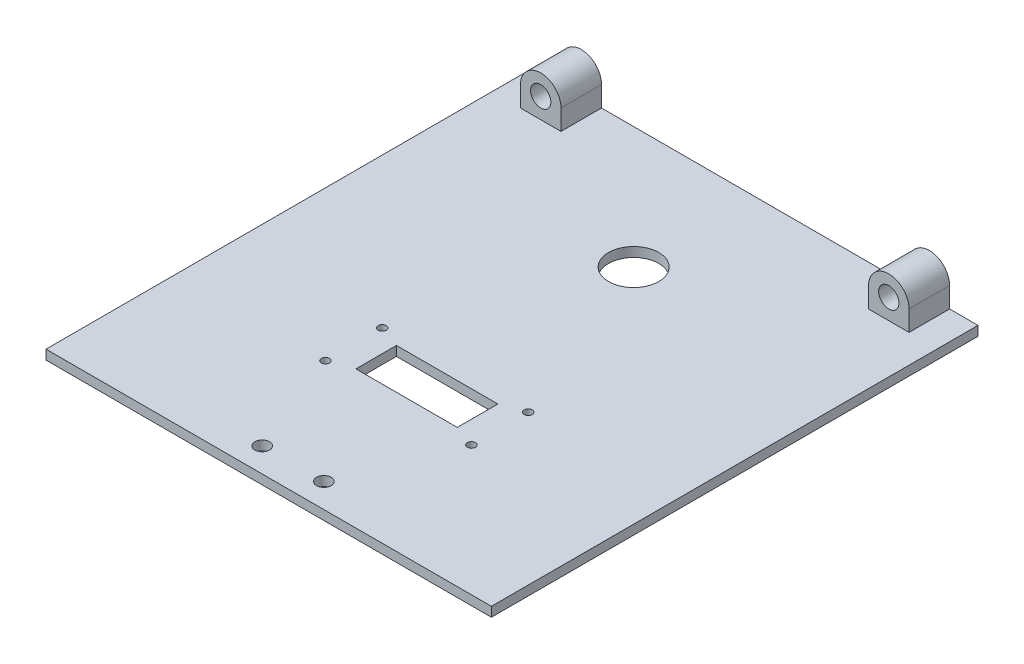
ISO-10303-21;
HEADER;
FILE_DESCRIPTION(('STEP AP214'),'2;1');
FILE_NAME('part.step','',(''),(''),'','','');
FILE_SCHEMA(('AUTOMOTIVE_DESIGN { 1 0 10303 214 1 1 1 1 }'));
ENDSEC;
DATA;
#1=APPLICATION_CONTEXT('core data for automotive mechanical design processes');
#2=APPLICATION_PROTOCOL_DEFINITION('international standard','automotive_design',2000,#1);
#3=PRODUCT_CONTEXT('',#1,'mechanical');
#4=PRODUCT('Part','Part','',(#3));
#5=PRODUCT_RELATED_PRODUCT_CATEGORY('part','',(#4));
#6=PRODUCT_DEFINITION_FORMATION('','',#4);
#7=PRODUCT_DEFINITION_CONTEXT('part definition',#1,'design');
#8=PRODUCT_DEFINITION('design','',#6,#7);
#9=PRODUCT_DEFINITION_SHAPE('','',#8);
#10=(LENGTH_UNIT() NAMED_UNIT(*) SI_UNIT(.MILLI.,.METRE.));
#11=(NAMED_UNIT(*) PLANE_ANGLE_UNIT() SI_UNIT($,.RADIAN.));
#12=(NAMED_UNIT(*) SI_UNIT($,.STERADIAN.) SOLID_ANGLE_UNIT());
#13=UNCERTAINTY_MEASURE_WITH_UNIT(LENGTH_MEASURE(1.E-05),#10,'distance_accuracy_value','');
#14=(GEOMETRIC_REPRESENTATION_CONTEXT(3) GLOBAL_UNCERTAINTY_ASSIGNED_CONTEXT((#13)) GLOBAL_UNIT_ASSIGNED_CONTEXT((#10,
#11,#12)) REPRESENTATION_CONTEXT('',''));
#15=CARTESIAN_POINT('',(0.,0.,0.));
#16=DIRECTION('',(0.,0.,1.));
#17=DIRECTION('',(1.,0.,0.));
#18=AXIS2_PLACEMENT_3D('',#15,#16,#17);
#19=CARTESIAN_POINT('',(0.,6.35,0.));
#20=DIRECTION('',(1.,0.,0.));
#21=DIRECTION('',(0.,0.,-1.));
#22=AXIS2_PLACEMENT_3D('',#19,#20,#21);
#23=PLANE('',#22);
#24=DIRECTION('',(0.,0.,1.));
#25=VECTOR('',#24,1.);
#26=CARTESIAN_POINT('',(0.,2.975,-152.4));
#27=LINE('',#26,#25);
#28=CARTESIAN_POINT('',(0.,2.975,-152.4));
#29=VERTEX_POINT('',#28);
#30=CARTESIAN_POINT('',(0.,2.975,0.));
#31=VERTEX_POINT('',#30);
#32=EDGE_CURVE('E310',#29,#31,#27,.T.);
#33=ORIENTED_EDGE('',*,*,#32,.F.);
#34=DIRECTION('',(0.,-1.,0.));
#35=VECTOR('',#34,1.);
#36=CARTESIAN_POINT('',(0.,6.35,-152.4));
#37=LINE('',#36,#35);
#38=CARTESIAN_POINT('',(0.,0.,-152.4));
#39=VERTEX_POINT('',#38);
#40=EDGE_CURVE('E350',#29,#39,#37,.T.);
#41=ORIENTED_EDGE('',*,*,#40,.T.);
#42=DIRECTION('',(0.,0.,1.));
#43=VECTOR('',#42,1.);
#44=CARTESIAN_POINT('',(0.,0.,0.));
#45=LINE('',#44,#43);
#46=CARTESIAN_POINT('',(0.,0.,0.));
#47=VERTEX_POINT('',#46);
#48=EDGE_CURVE('E333',#39,#47,#45,.T.);
#49=ORIENTED_EDGE('',*,*,#48,.T.);
#50=DIRECTION('',(0.,-1.,0.));
#51=VECTOR('',#50,1.);
#52=CARTESIAN_POINT('',(0.,6.35,0.));
#53=LINE('',#52,#51);
#54=EDGE_CURVE('E359',#31,#47,#53,.T.);
#55=ORIENTED_EDGE('',*,*,#54,.F.);
#56=EDGE_LOOP('',(#33,#41,#49,#55));
#57=FACE_BOUND('',#56,.T.);
#58=ADVANCED_FACE('F38',(#57),#23,.F.);
#59=CARTESIAN_POINT('',(0.,6.35,0.));
#60=DIRECTION('',(0.,0.,-1.));
#61=DIRECTION('',(-1.,0.,0.));
#62=AXIS2_PLACEMENT_3D('',#59,#60,#61);
#63=PLANE('',#62);
#64=DIRECTION('',(1.,0.,0.));
#65=VECTOR('',#64,1.);
#66=CARTESIAN_POINT('',(0.,2.975,0.));
#67=LINE('',#66,#65);
#68=CARTESIAN_POINT('',(139.5,2.975,0.));
#69=VERTEX_POINT('',#68);
#70=EDGE_CURVE('E322',#31,#69,#67,.T.);
#71=ORIENTED_EDGE('',*,*,#70,.F.);
#72=ORIENTED_EDGE('',*,*,#54,.T.);
#73=DIRECTION('',(1.,0.,0.));
#74=VECTOR('',#73,1.);
#75=CARTESIAN_POINT('',(0.,0.,0.));
#76=LINE('',#75,#74);
#77=CARTESIAN_POINT('',(139.5,0.,0.));
#78=VERTEX_POINT('',#77);
#79=EDGE_CURVE('E338',#47,#78,#76,.T.);
#80=ORIENTED_EDGE('',*,*,#79,.T.);
#81=DIRECTION('',(0.,-1.,0.));
#82=VECTOR('',#81,1.);
#83=CARTESIAN_POINT('',(139.5,6.35,0.));
#84=LINE('',#83,#82);
#85=EDGE_CURVE('E356',#69,#78,#84,.T.);
#86=ORIENTED_EDGE('',*,*,#85,.F.);
#87=EDGE_LOOP('',(#71,#72,#80,#86));
#88=FACE_BOUND('',#87,.T.);
#89=ADVANCED_FACE('F440',(#88),#63,.F.);
#90=CARTESIAN_POINT('',(139.5,6.35,0.));
#91=DIRECTION('',(-1.,0.,0.));
#92=DIRECTION('',(0.,0.,1.));
#93=AXIS2_PLACEMENT_3D('',#90,#91,#92);
#94=PLANE('',#93);
#95=DIRECTION('',(0.,0.,-1.));
#96=VECTOR('',#95,1.);
#97=CARTESIAN_POINT('',(139.5,2.975,-152.4));
#98=LINE('',#97,#96);
#99=CARTESIAN_POINT('',(139.5,2.975,-152.4));
#100=VERTEX_POINT('',#99);
#101=EDGE_CURVE('E325',#69,#100,#98,.T.);
#102=ORIENTED_EDGE('',*,*,#101,.F.);
#103=ORIENTED_EDGE('',*,*,#85,.T.);
#104=DIRECTION('',(0.,0.,-1.));
#105=VECTOR('',#104,1.);
#106=CARTESIAN_POINT('',(139.5,0.,0.));
#107=LINE('',#106,#105);
#108=CARTESIAN_POINT('',(139.5,0.,-152.4));
#109=VERTEX_POINT('',#108);
#110=EDGE_CURVE('E342',#78,#109,#107,.T.);
#111=ORIENTED_EDGE('',*,*,#110,.T.);
#112=DIRECTION('',(0.,-1.,0.));
#113=VECTOR('',#112,1.);
#114=CARTESIAN_POINT('',(139.5,6.35,-152.4));
#115=LINE('',#114,#113);
#116=EDGE_CURVE('E353',#100,#109,#115,.T.);
#117=ORIENTED_EDGE('',*,*,#116,.F.);
#118=EDGE_LOOP('',(#102,#103,#111,#117));
#119=FACE_BOUND('',#118,.T.);
#120=ADVANCED_FACE('F445',(#119),#94,.F.);
#121=CARTESIAN_POINT('',(0.,6.35,-152.4));
#122=DIRECTION('',(0.,0.,1.));
#123=DIRECTION('',(1.,0.,0.));
#124=AXIS2_PLACEMENT_3D('',#121,#122,#123);
#125=PLANE('',#124);
#126=DIRECTION('',(-1.,0.,0.));
#127=VECTOR('',#126,1.);
#128=CARTESIAN_POINT('',(0.,2.975,-152.4));
#129=LINE('',#128,#127);
#130=CARTESIAN_POINT('',(130.61,2.975,-152.4));
#131=VERTEX_POINT('',#130);
#132=EDGE_CURVE('E329',#100,#131,#129,.T.);
#133=ORIENTED_EDGE('',*,*,#132,.F.);
#134=ORIENTED_EDGE('',*,*,#116,.T.);
#135=DIRECTION('',(-1.,0.,0.));
#136=VECTOR('',#135,1.);
#137=CARTESIAN_POINT('',(0.,0.,-152.4));
#138=LINE('',#137,#136);
#139=EDGE_CURVE('E346',#109,#39,#138,.T.);
#140=ORIENTED_EDGE('',*,*,#139,.T.);
#141=ORIENTED_EDGE('',*,*,#40,.F.);
#142=CARTESIAN_POINT('',(8.89,2.975,-152.4));
#143=VERTEX_POINT('',#142);
#144=EDGE_CURVE('E328',#143,#29,#129,.T.);
#145=ORIENTED_EDGE('',*,*,#144,.F.);
#146=DIRECTION('',(0.,1.,0.));
#147=VECTOR('',#146,1.);
#148=CARTESIAN_POINT('',(8.89,9.325,-152.4));
#149=LINE('',#148,#147);
#150=CARTESIAN_POINT('',(8.89,9.325,-152.4));
#151=VERTEX_POINT('',#150);
#152=EDGE_CURVE('E235',#143,#151,#149,.T.);
#153=ORIENTED_EDGE('',*,*,#152,.T.);
#154=CARTESIAN_POINT('',(15.24,9.325,-152.4));
#155=DIRECTION('',(0.,0.,-1.));
#156=DIRECTION('',(-1.,0.,0.));
#157=AXIS2_PLACEMENT_3D('',#154,#155,#156);
#158=CIRCLE('',#157,6.35);
#159=CARTESIAN_POINT('',(21.59,9.325,-152.4));
#160=VERTEX_POINT('',#159);
#161=EDGE_CURVE('E225',#151,#160,#158,.T.);
#162=ORIENTED_EDGE('',*,*,#161,.T.);
#163=DIRECTION('',(0.,-1.,0.));
#164=VECTOR('',#163,1.);
#165=CARTESIAN_POINT('',(21.59,9.325,-152.4));
#166=LINE('',#165,#164);
#167=CARTESIAN_POINT('',(21.59,2.975,-152.4));
#168=VERTEX_POINT('',#167);
#169=EDGE_CURVE('E250',#160,#168,#166,.T.);
#170=ORIENTED_EDGE('',*,*,#169,.T.);
#171=CARTESIAN_POINT('',(117.91,2.975,-152.4));
#172=VERTEX_POINT('',#171);
#173=EDGE_CURVE('E334',#172,#168,#129,.T.);
#174=ORIENTED_EDGE('',*,*,#173,.F.);
#175=DIRECTION('',(0.,1.,0.));
#176=VECTOR('',#175,1.);
#177=CARTESIAN_POINT('',(117.91,9.325,-152.4));
#178=LINE('',#177,#176);
#179=CARTESIAN_POINT('',(117.91,9.325,-152.4));
#180=VERTEX_POINT('',#179);
#181=EDGE_CURVE('E284',#172,#180,#178,.T.);
#182=ORIENTED_EDGE('',*,*,#181,.T.);
#183=CARTESIAN_POINT('',(124.26,9.325,-152.4));
#184=DIRECTION('',(0.,0.,-1.));
#185=DIRECTION('',(-1.,0.,0.));
#186=AXIS2_PLACEMENT_3D('',#183,#184,#185);
#187=CIRCLE('',#186,6.35);
#188=CARTESIAN_POINT('',(130.61,9.325,-152.4));
#189=VERTEX_POINT('',#188);
#190=EDGE_CURVE('E275',#180,#189,#187,.T.);
#191=ORIENTED_EDGE('',*,*,#190,.T.);
#192=DIRECTION('',(0.,-1.,0.));
#193=VECTOR('',#192,1.);
#194=CARTESIAN_POINT('',(130.61,9.325,-152.4));
#195=LINE('',#194,#193);
#196=EDGE_CURVE('E300',#189,#131,#195,.T.);
#197=ORIENTED_EDGE('',*,*,#196,.T.);
#198=EDGE_LOOP('',(#133,#134,#140,#141,#145,#153,#162,#170,#174,#182,#191,#197));
#199=FACE_BOUND('',#198,.T.);
#200=CARTESIAN_POINT('',(124.26,9.325,-152.4));
#201=DIRECTION('',(0.,0.,-1.));
#202=DIRECTION('',(-1.,0.,0.));
#203=AXIS2_PLACEMENT_3D('',#200,#201,#202);
#204=CIRCLE('',#203,3.17500000072341);
#205=CARTESIAN_POINT('',(121.084999999277,9.325,-152.4));
#206=VERTEX_POINT('',#205);
#207=EDGE_CURVE('E260',#206,#206,#204,.T.);
#208=ORIENTED_EDGE('',*,*,#207,.F.);
#209=EDGE_LOOP('',(#208));
#210=FACE_BOUND('',#209,.T.);
#211=CARTESIAN_POINT('',(15.24,9.325,-152.4));
#212=DIRECTION('',(0.,0.,-1.));
#213=DIRECTION('',(-1.,0.,0.));
#214=AXIS2_PLACEMENT_3D('',#211,#212,#213);
#215=CIRCLE('',#214,3.17500000036169);
#216=CARTESIAN_POINT('',(12.0649999996383,9.325,-152.4));
#217=VERTEX_POINT('',#216);
#218=EDGE_CURVE('E226',#217,#217,#215,.T.);
#219=ORIENTED_EDGE('',*,*,#218,.F.);
#220=EDGE_LOOP('',(#219));
#221=FACE_BOUND('',#220,.T.);
#222=ADVANCED_FACE('F412',(#199,#210,#221),#125,.F.);
#223=CARTESIAN_POINT('',(0.,0.,0.));
#224=DIRECTION('',(0.,-1.,0.));
#225=DIRECTION('',(0.,0.,-1.));
#226=AXIS2_PLACEMENT_3D('',#223,#224,#225);
#227=PLANE('',#226);
#228=CARTESIAN_POINT('',(46.89,0.,-58.42));
#229=DIRECTION('',(0.,-1.,0.));
#230=DIRECTION('',(0.,0.,-1.));
#231=AXIS2_PLACEMENT_3D('',#228,#229,#230);
#232=CIRCLE('',#231,1.27);
#233=CARTESIAN_POINT('',(46.89,0.,-59.69));
#234=VERTEX_POINT('',#233);
#235=EDGE_CURVE('E196',#234,#234,#232,.T.);
#236=ORIENTED_EDGE('',*,*,#235,.F.);
#237=EDGE_LOOP('',(#236));
#238=FACE_BOUND('',#237,.T.);
#239=CARTESIAN_POINT('',(92.61,0.,-58.42));
#240=DIRECTION('',(0.,-1.,0.));
#241=DIRECTION('',(0.,0.,-1.));
#242=AXIS2_PLACEMENT_3D('',#239,#240,#241);
#243=CIRCLE('',#242,1.26999999999999);
#244=CARTESIAN_POINT('',(92.61,0.,-59.69));
#245=VERTEX_POINT('',#244);
#246=EDGE_CURVE('E192',#245,#245,#243,.T.);
#247=ORIENTED_EDGE('',*,*,#246,.F.);
#248=EDGE_LOOP('',(#247));
#249=FACE_BOUND('',#248,.T.);
#250=CARTESIAN_POINT('',(92.61,0.,-40.64));
#251=DIRECTION('',(0.,-1.,0.));
#252=DIRECTION('',(0.,0.,-1.));
#253=AXIS2_PLACEMENT_3D('',#250,#251,#252);
#254=CIRCLE('',#253,1.26999999999999);
#255=CARTESIAN_POINT('',(92.61,0.,-41.91));
#256=VERTEX_POINT('',#255);
#257=EDGE_CURVE('E187',#256,#256,#254,.T.);
#258=ORIENTED_EDGE('',*,*,#257,.F.);
#259=EDGE_LOOP('',(#258));
#260=FACE_BOUND('',#259,.T.);
#261=CARTESIAN_POINT('',(46.89,0.,-40.64));
#262=DIRECTION('',(0.,-1.,0.));
#263=DIRECTION('',(0.,0.,-1.));
#264=AXIS2_PLACEMENT_3D('',#261,#262,#263);
#265=CIRCLE('',#264,1.27);
#266=CARTESIAN_POINT('',(46.89,0.,-41.91));
#267=VERTEX_POINT('',#266);
#268=EDGE_CURVE('E182',#267,#267,#265,.T.);
#269=ORIENTED_EDGE('',*,*,#268,.F.);
#270=EDGE_LOOP('',(#269));
#271=FACE_BOUND('',#270,.T.);
#272=DIRECTION('',(0.,0.,-1.));
#273=VECTOR('',#272,1.);
#274=CARTESIAN_POINT('',(53.875,0.,0.));
#275=LINE('',#274,#273);
#276=CARTESIAN_POINT('',(53.875,0.,-43.18));
#277=VERTEX_POINT('',#276);
#278=CARTESIAN_POINT('',(53.875,0.,-55.88));
#279=VERTEX_POINT('',#278);
#280=EDGE_CURVE('E175',#277,#279,#275,.T.);
#281=ORIENTED_EDGE('',*,*,#280,.F.);
#282=DIRECTION('',(-1.,0.,0.));
#283=VECTOR('',#282,1.);
#284=CARTESIAN_POINT('',(0.,0.,-43.18));
#285=LINE('',#284,#283);
#286=CARTESIAN_POINT('',(85.625,0.,-43.18));
#287=VERTEX_POINT('',#286);
#288=EDGE_CURVE('E171',#287,#277,#285,.T.);
#289=ORIENTED_EDGE('',*,*,#288,.F.);
#290=DIRECTION('',(0.,0.,1.));
#291=VECTOR('',#290,1.);
#292=CARTESIAN_POINT('',(85.625,0.,0.));
#293=LINE('',#292,#291);
#294=CARTESIAN_POINT('',(85.625,0.,-55.88));
#295=VERTEX_POINT('',#294);
#296=EDGE_CURVE('E155',#295,#287,#293,.T.);
#297=ORIENTED_EDGE('',*,*,#296,.F.);
#298=DIRECTION('',(1.,0.,0.));
#299=VECTOR('',#298,1.);
#300=CARTESIAN_POINT('',(0.,0.,-55.88));
#301=LINE('',#300,#299);
#302=EDGE_CURVE('E149',#279,#295,#301,.T.);
#303=ORIENTED_EDGE('',*,*,#302,.F.);
#304=EDGE_LOOP('',(#281,#289,#297,#303));
#305=FACE_BOUND('',#304,.T.);
#306=CARTESIAN_POINT('',(60.098,0.,-7.62000000000001));
#307=DIRECTION('',(0.,1.,0.));
#308=DIRECTION('',(0.,0.,1.));
#309=AXIS2_PLACEMENT_3D('',#306,#307,#308);
#310=CIRCLE('',#309,2.28599999999998);
#311=CARTESIAN_POINT('',(60.098,0.,-5.33400000000003));
#312=VERTEX_POINT('',#311);
#313=EDGE_CURVE('E201',#312,#312,#310,.T.);
#314=ORIENTED_EDGE('',*,*,#313,.T.);
#315=EDGE_LOOP('',(#314));
#316=FACE_BOUND('',#315,.T.);
#317=CARTESIAN_POINT('',(79.402,0.,-7.62000000000002));
#318=DIRECTION('',(0.,1.,0.));
#319=DIRECTION('',(0.,0.,1.));
#320=AXIS2_PLACEMENT_3D('',#317,#318,#319);
#321=CIRCLE('',#320,2.28599999999999);
#322=CARTESIAN_POINT('',(79.402,0.,-5.33400000000002));
#323=VERTEX_POINT('',#322);
#324=EDGE_CURVE('E210',#323,#323,#321,.T.);
#325=ORIENTED_EDGE('',*,*,#324,.T.);
#326=EDGE_LOOP('',(#325));
#327=FACE_BOUND('',#326,.T.);
#328=CARTESIAN_POINT('',(69.75,0.,-114.3));
#329=DIRECTION('',(0.,-1.,0.));
#330=DIRECTION('',(0.,0.,-1.));
#331=AXIS2_PLACEMENT_3D('',#328,#329,#330);
#332=CIRCLE('',#331,7.874);
#333=CARTESIAN_POINT('',(69.75,0.,-122.174));
#334=VERTEX_POINT('',#333);
#335=EDGE_CURVE('E205',#334,#334,#332,.T.);
#336=ORIENTED_EDGE('',*,*,#335,.F.);
#337=EDGE_LOOP('',(#336));
#338=FACE_BOUND('',#337,.T.);
#339=ORIENTED_EDGE('',*,*,#48,.F.);
#340=ORIENTED_EDGE('',*,*,#139,.F.);
#341=ORIENTED_EDGE('',*,*,#110,.F.);
#342=ORIENTED_EDGE('',*,*,#79,.F.);
#343=EDGE_LOOP('',(#339,#340,#341,#342));
#344=FACE_BOUND('',#343,.T.);
#345=ADVANCED_FACE('F169',(#238,#249,#260,#271,#305,#316,#327,#338,#344),#227,.T.);
#346=CARTESIAN_POINT('',(0.,2.975,0.));
#347=DIRECTION('',(0.,1.,0.));
#348=DIRECTION('',(0.,0.,1.));
#349=AXIS2_PLACEMENT_3D('',#346,#347,#348);
#350=PLANE('',#349);
#351=CARTESIAN_POINT('',(46.89,2.975,-58.42));
#352=DIRECTION('',(0.,1.,0.));
#353=DIRECTION('',(0.,0.,1.));
#354=AXIS2_PLACEMENT_3D('',#351,#352,#353);
#355=CIRCLE('',#354,1.27);
#356=CARTESIAN_POINT('',(46.89,2.975,-57.15));
#357=VERTEX_POINT('',#356);
#358=EDGE_CURVE('E41',#357,#357,#355,.T.);
#359=ORIENTED_EDGE('',*,*,#358,.F.);
#360=EDGE_LOOP('',(#359));
#361=FACE_BOUND('',#360,.T.);
#362=CARTESIAN_POINT('',(92.61,2.975,-58.42));
#363=DIRECTION('',(0.,1.,0.));
#364=DIRECTION('',(0.,0.,1.));
#365=AXIS2_PLACEMENT_3D('',#362,#363,#364);
#366=CIRCLE('',#365,1.26999999999999);
#367=CARTESIAN_POINT('',(92.61,2.975,-57.15));
#368=VERTEX_POINT('',#367);
#369=EDGE_CURVE('E191',#368,#368,#366,.T.);
#370=ORIENTED_EDGE('',*,*,#369,.F.);
#371=EDGE_LOOP('',(#370));
#372=FACE_BOUND('',#371,.T.);
#373=CARTESIAN_POINT('',(92.61,2.975,-40.64));
#374=DIRECTION('',(0.,1.,0.));
#375=DIRECTION('',(0.,0.,1.));
#376=AXIS2_PLACEMENT_3D('',#373,#374,#375);
#377=CIRCLE('',#376,1.26999999999999);
#378=CARTESIAN_POINT('',(92.61,2.975,-39.37));
#379=VERTEX_POINT('',#378);
#380=EDGE_CURVE('E186',#379,#379,#377,.T.);
#381=ORIENTED_EDGE('',*,*,#380,.F.);
#382=EDGE_LOOP('',(#381));
#383=FACE_BOUND('',#382,.T.);
#384=CARTESIAN_POINT('',(46.89,2.975,-40.64));
#385=DIRECTION('',(0.,1.,0.));
#386=DIRECTION('',(0.,0.,1.));
#387=AXIS2_PLACEMENT_3D('',#384,#385,#386);
#388=CIRCLE('',#387,1.27);
#389=CARTESIAN_POINT('',(46.89,2.975,-39.37));
#390=VERTEX_POINT('',#389);
#391=EDGE_CURVE('E181',#390,#390,#388,.T.);
#392=ORIENTED_EDGE('',*,*,#391,.F.);
#393=EDGE_LOOP('',(#392));
#394=FACE_BOUND('',#393,.T.);
#395=DIRECTION('',(0.,0.,1.));
#396=VECTOR('',#395,1.);
#397=CARTESIAN_POINT('',(53.875,2.975,0.));
#398=LINE('',#397,#396);
#399=CARTESIAN_POINT('',(53.875,2.975,-55.88));
#400=VERTEX_POINT('',#399);
#401=CARTESIAN_POINT('',(53.875,2.975,-43.18));
#402=VERTEX_POINT('',#401);
#403=EDGE_CURVE('E11',#400,#402,#398,.T.);
#404=ORIENTED_EDGE('',*,*,#403,.F.);
#405=DIRECTION('',(-1.,0.,0.));
#406=VECTOR('',#405,1.);
#407=CARTESIAN_POINT('',(0.,2.975,-55.88));
#408=LINE('',#407,#406);
#409=CARTESIAN_POINT('',(85.625,2.975,-55.88));
#410=VERTEX_POINT('',#409);
#411=EDGE_CURVE('E362',#410,#400,#408,.T.);
#412=ORIENTED_EDGE('',*,*,#411,.F.);
#413=DIRECTION('',(0.,0.,-1.));
#414=VECTOR('',#413,1.);
#415=CARTESIAN_POINT('',(85.625,2.975,0.));
#416=LINE('',#415,#414);
#417=CARTESIAN_POINT('',(85.625,2.975,-43.18));
#418=VERTEX_POINT('',#417);
#419=EDGE_CURVE('E163',#418,#410,#416,.T.);
#420=ORIENTED_EDGE('',*,*,#419,.F.);
#421=DIRECTION('',(1.,0.,0.));
#422=VECTOR('',#421,1.);
#423=CARTESIAN_POINT('',(0.,2.975,-43.18));
#424=LINE('',#423,#422);
#425=EDGE_CURVE('E47',#402,#418,#424,.T.);
#426=ORIENTED_EDGE('',*,*,#425,.F.);
#427=EDGE_LOOP('',(#404,#412,#420,#426));
#428=FACE_BOUND('',#427,.T.);
#429=CARTESIAN_POINT('',(60.098,2.975,-7.62000000000001));
#430=DIRECTION('',(0.,1.,0.));
#431=DIRECTION('',(0.,0.,1.));
#432=AXIS2_PLACEMENT_3D('',#429,#430,#431);
#433=CIRCLE('',#432,2.28599999999998);
#434=CARTESIAN_POINT('',(60.098,2.975,-5.33400000000003));
#435=VERTEX_POINT('',#434);
#436=EDGE_CURVE('E206',#435,#435,#433,.T.);
#437=ORIENTED_EDGE('',*,*,#436,.F.);
#438=EDGE_LOOP('',(#437));
#439=FACE_BOUND('',#438,.T.);
#440=CARTESIAN_POINT('',(79.402,2.975,-7.62000000000002));
#441=DIRECTION('',(0.,1.,0.));
#442=DIRECTION('',(0.,0.,1.));
#443=AXIS2_PLACEMENT_3D('',#440,#441,#442);
#444=CIRCLE('',#443,2.28599999999999);
#445=CARTESIAN_POINT('',(79.402,2.975,-5.33400000000002));
#446=VERTEX_POINT('',#445);
#447=EDGE_CURVE('E200',#446,#446,#444,.T.);
#448=ORIENTED_EDGE('',*,*,#447,.F.);
#449=EDGE_LOOP('',(#448));
#450=FACE_BOUND('',#449,.T.);
#451=CARTESIAN_POINT('',(69.75,2.975,-114.3));
#452=DIRECTION('',(0.,1.,0.));
#453=DIRECTION('',(0.,0.,1.));
#454=AXIS2_PLACEMENT_3D('',#451,#452,#453);
#455=CIRCLE('',#454,7.874);
#456=CARTESIAN_POINT('',(69.75,2.975,-106.426));
#457=VERTEX_POINT('',#456);
#458=EDGE_CURVE('E220',#457,#457,#455,.T.);
#459=ORIENTED_EDGE('',*,*,#458,.F.);
#460=EDGE_LOOP('',(#459));
#461=FACE_BOUND('',#460,.T.);
#462=DIRECTION('',(0.,0.,-1.));
#463=VECTOR('',#462,1.);
#464=CARTESIAN_POINT('',(8.89,2.975,-139.7));
#465=LINE('',#464,#463);
#466=CARTESIAN_POINT('',(8.89,2.975,-139.7));
#467=VERTEX_POINT('',#466);
#468=EDGE_CURVE('E261',#467,#143,#465,.T.);
#469=ORIENTED_EDGE('',*,*,#468,.T.);
#470=ORIENTED_EDGE('',*,*,#144,.T.);
#471=ORIENTED_EDGE('',*,*,#32,.T.);
#472=ORIENTED_EDGE('',*,*,#70,.T.);
#473=ORIENTED_EDGE('',*,*,#101,.T.);
#474=ORIENTED_EDGE('',*,*,#132,.T.);
#475=DIRECTION('',(0.,0.,-1.));
#476=VECTOR('',#475,1.);
#477=CARTESIAN_POINT('',(130.61,2.975,-139.7));
#478=LINE('',#477,#476);
#479=CARTESIAN_POINT('',(130.61,2.975,-139.7));
#480=VERTEX_POINT('',#479);
#481=EDGE_CURVE('E315',#480,#131,#478,.T.);
#482=ORIENTED_EDGE('',*,*,#481,.F.);
#483=DIRECTION('',(-1.,0.,0.));
#484=VECTOR('',#483,1.);
#485=CARTESIAN_POINT('',(130.61,2.975,-139.7));
#486=LINE('',#485,#484);
#487=CARTESIAN_POINT('',(117.91,2.975,-139.7));
#488=VERTEX_POINT('',#487);
#489=EDGE_CURVE('E288',#480,#488,#486,.T.);
#490=ORIENTED_EDGE('',*,*,#489,.T.);
#491=DIRECTION('',(0.,0.,-1.));
#492=VECTOR('',#491,1.);
#493=CARTESIAN_POINT('',(117.91,2.975,-139.7));
#494=LINE('',#493,#492);
#495=EDGE_CURVE('E311',#488,#172,#494,.T.);
#496=ORIENTED_EDGE('',*,*,#495,.T.);
#497=ORIENTED_EDGE('',*,*,#173,.T.);
#498=DIRECTION('',(0.,0.,-1.));
#499=VECTOR('',#498,1.);
#500=CARTESIAN_POINT('',(21.59,2.975,-139.7));
#501=LINE('',#500,#499);
#502=CARTESIAN_POINT('',(21.59,2.975,-139.7));
#503=VERTEX_POINT('',#502);
#504=EDGE_CURVE('E265',#503,#168,#501,.T.);
#505=ORIENTED_EDGE('',*,*,#504,.F.);
#506=DIRECTION('',(-1.,0.,0.));
#507=VECTOR('',#506,1.);
#508=CARTESIAN_POINT('',(21.59,2.975,-139.7));
#509=LINE('',#508,#507);
#510=EDGE_CURVE('E239',#503,#467,#509,.T.);
#511=ORIENTED_EDGE('',*,*,#510,.T.);
#512=EDGE_LOOP('',(#469,#470,#471,#472,#473,#474,#482,#490,#496,#497,#505,#511));
#513=FACE_BOUND('',#512,.T.);
#514=ADVANCED_FACE('F383',(#361,#372,#383,#394,#428,#439,#450,#461,#513),#350,.T.);
#515=CARTESIAN_POINT('',(124.26,9.325,-139.7));
#516=DIRECTION('',(0.,0.,-1.));
#517=DIRECTION('',(-1.,0.,0.));
#518=AXIS2_PLACEMENT_3D('',#515,#516,#517);
#519=CYLINDRICAL_SURFACE('',#518,6.35);
#520=ORIENTED_EDGE('',*,*,#190,.F.);
#521=DIRECTION('',(0.,0.,-1.));
#522=VECTOR('',#521,1.);
#523=CARTESIAN_POINT('',(117.91,9.325,-139.7));
#524=LINE('',#523,#522);
#525=CARTESIAN_POINT('',(117.91,9.325,-139.7));
#526=VERTEX_POINT('',#525);
#527=EDGE_CURVE('E307',#526,#180,#524,.T.);
#528=ORIENTED_EDGE('',*,*,#527,.F.);
#529=CARTESIAN_POINT('',(124.26,9.325,-139.7));
#530=DIRECTION('',(0.,0.,-1.));
#531=DIRECTION('',(-1.,0.,0.));
#532=AXIS2_PLACEMENT_3D('',#529,#530,#531);
#533=CIRCLE('',#532,6.35);
#534=CARTESIAN_POINT('',(130.61,9.325,-139.7));
#535=VERTEX_POINT('',#534);
#536=EDGE_CURVE('E279',#526,#535,#533,.T.);
#537=ORIENTED_EDGE('',*,*,#536,.T.);
#538=DIRECTION('',(0.,0.,-1.));
#539=VECTOR('',#538,1.);
#540=CARTESIAN_POINT('',(130.61,9.325,-139.7));
#541=LINE('',#540,#539);
#542=EDGE_CURVE('E296',#535,#189,#541,.T.);
#543=ORIENTED_EDGE('',*,*,#542,.T.);
#544=EDGE_LOOP('',(#520,#528,#537,#543));
#545=FACE_BOUND('',#544,.T.);
#546=ADVANCED_FACE('F386',(#545),#519,.T.);
#547=CARTESIAN_POINT('',(117.91,9.325,-139.7));
#548=DIRECTION('',(-1.,0.,0.));
#549=DIRECTION('',(0.,0.,1.));
#550=AXIS2_PLACEMENT_3D('',#547,#548,#549);
#551=PLANE('',#550);
#552=ORIENTED_EDGE('',*,*,#181,.F.);
#553=ORIENTED_EDGE('',*,*,#495,.F.);
#554=DIRECTION('',(0.,1.,0.));
#555=VECTOR('',#554,1.);
#556=CARTESIAN_POINT('',(117.91,9.325,-139.7));
#557=LINE('',#556,#555);
#558=EDGE_CURVE('E292',#488,#526,#557,.T.);
#559=ORIENTED_EDGE('',*,*,#558,.T.);
#560=ORIENTED_EDGE('',*,*,#527,.T.);
#561=EDGE_LOOP('',(#552,#553,#559,#560));
#562=FACE_BOUND('',#561,.T.);
#563=ADVANCED_FACE('F466',(#562),#551,.T.);
#564=CARTESIAN_POINT('',(130.61,9.325,-139.7));
#565=DIRECTION('',(1.,0.,0.));
#566=DIRECTION('',(0.,0.,-1.));
#567=AXIS2_PLACEMENT_3D('',#564,#565,#566);
#568=PLANE('',#567);
#569=ORIENTED_EDGE('',*,*,#196,.F.);
#570=ORIENTED_EDGE('',*,*,#542,.F.);
#571=DIRECTION('',(0.,-1.,0.));
#572=VECTOR('',#571,1.);
#573=CARTESIAN_POINT('',(130.61,9.325,-139.7));
#574=LINE('',#573,#572);
#575=EDGE_CURVE('E283',#535,#480,#574,.T.);
#576=ORIENTED_EDGE('',*,*,#575,.T.);
#577=ORIENTED_EDGE('',*,*,#481,.T.);
#578=EDGE_LOOP('',(#569,#570,#576,#577));
#579=FACE_BOUND('',#578,.T.);
#580=ADVANCED_FACE('F460',(#579),#568,.T.);
#581=CARTESIAN_POINT('',(124.26,9.325,-139.7));
#582=DIRECTION('',(0.,0.,-1.));
#583=DIRECTION('',(-1.,0.,0.));
#584=AXIS2_PLACEMENT_3D('',#581,#582,#583);
#585=PLANE('',#584);
#586=CARTESIAN_POINT('',(124.26,9.325,-139.7));
#587=DIRECTION('',(0.,0.,-1.));
#588=DIRECTION('',(-1.,0.,0.));
#589=AXIS2_PLACEMENT_3D('',#586,#587,#588);
#590=CIRCLE('',#589,3.17500000072341);
#591=CARTESIAN_POINT('',(121.084999999277,9.325,-139.7));
#592=VERTEX_POINT('',#591);
#593=EDGE_CURVE('E271',#592,#592,#590,.T.);
#594=ORIENTED_EDGE('',*,*,#593,.T.);
#595=EDGE_LOOP('',(#594));
#596=FACE_BOUND('',#595,.T.);
#597=ORIENTED_EDGE('',*,*,#536,.F.);
#598=ORIENTED_EDGE('',*,*,#558,.F.);
#599=ORIENTED_EDGE('',*,*,#489,.F.);
#600=ORIENTED_EDGE('',*,*,#575,.F.);
#601=EDGE_LOOP('',(#597,#598,#599,#600));
#602=FACE_BOUND('',#601,.T.);
#603=ADVANCED_FACE('F435',(#596,#602),#585,.F.);
#604=CARTESIAN_POINT('',(124.26,9.325,-139.7));
#605=DIRECTION('',(0.,0.,-1.));
#606=DIRECTION('',(-1.,0.,0.));
#607=AXIS2_PLACEMENT_3D('',#604,#605,#606);
#608=CYLINDRICAL_SURFACE('',#607,3.17500000072341);
#609=ORIENTED_EDGE('',*,*,#593,.F.);
#610=EDGE_LOOP('',(#609));
#611=FACE_BOUND('',#610,.T.);
#612=ORIENTED_EDGE('',*,*,#207,.T.);
#613=EDGE_LOOP('',(#612));
#614=FACE_BOUND('',#613,.T.);
#615=ADVANCED_FACE('F428',(#611,#614),#608,.F.);
#616=CARTESIAN_POINT('',(15.24,9.325,-139.7));
#617=DIRECTION('',(0.,0.,-1.));
#618=DIRECTION('',(-1.,0.,0.));
#619=AXIS2_PLACEMENT_3D('',#616,#617,#618);
#620=CYLINDRICAL_SURFACE('',#619,6.35);
#621=ORIENTED_EDGE('',*,*,#161,.F.);
#622=DIRECTION('',(0.,0.,-1.));
#623=VECTOR('',#622,1.);
#624=CARTESIAN_POINT('',(8.89,9.325,-139.7));
#625=LINE('',#624,#623);
#626=CARTESIAN_POINT('',(8.89,9.325,-139.7));
#627=VERTEX_POINT('',#626);
#628=EDGE_CURVE('E257',#627,#151,#625,.T.);
#629=ORIENTED_EDGE('',*,*,#628,.F.);
#630=CARTESIAN_POINT('',(15.24,9.325,-139.7));
#631=DIRECTION('',(0.,0.,-1.));
#632=DIRECTION('',(-1.,0.,0.));
#633=AXIS2_PLACEMENT_3D('',#630,#631,#632);
#634=CIRCLE('',#633,6.35);
#635=CARTESIAN_POINT('',(21.59,9.325,-139.7));
#636=VERTEX_POINT('',#635);
#637=EDGE_CURVE('E230',#627,#636,#634,.T.);
#638=ORIENTED_EDGE('',*,*,#637,.T.);
#639=DIRECTION('',(0.,0.,-1.));
#640=VECTOR('',#639,1.);
#641=CARTESIAN_POINT('',(21.59,9.325,-139.7));
#642=LINE('',#641,#640);
#643=EDGE_CURVE('E246',#636,#160,#642,.T.);
#644=ORIENTED_EDGE('',*,*,#643,.T.);
#645=EDGE_LOOP('',(#621,#629,#638,#644));
#646=FACE_BOUND('',#645,.T.);
#647=ADVANCED_FACE('F426',(#646),#620,.T.);
#648=CARTESIAN_POINT('',(8.89,9.325,-139.7));
#649=DIRECTION('',(-1.,0.,0.));
#650=DIRECTION('',(0.,-1.,0.));
#651=AXIS2_PLACEMENT_3D('',#648,#649,#650);
#652=PLANE('',#651);
#653=ORIENTED_EDGE('',*,*,#152,.F.);
#654=ORIENTED_EDGE('',*,*,#468,.F.);
#655=DIRECTION('',(0.,1.,0.));
#656=VECTOR('',#655,1.);
#657=CARTESIAN_POINT('',(8.89,9.325,-139.7));
#658=LINE('',#657,#656);
#659=EDGE_CURVE('E242',#467,#627,#658,.T.);
#660=ORIENTED_EDGE('',*,*,#659,.T.);
#661=ORIENTED_EDGE('',*,*,#628,.T.);
#662=EDGE_LOOP('',(#653,#654,#660,#661));
#663=FACE_BOUND('',#662,.T.);
#664=ADVANCED_FACE('F408',(#663),#652,.T.);
#665=CARTESIAN_POINT('',(21.59,9.325,-139.7));
#666=DIRECTION('',(1.,0.,0.));
#667=DIRECTION('',(0.,1.,0.));
#668=AXIS2_PLACEMENT_3D('',#665,#666,#667);
#669=PLANE('',#668);
#670=ORIENTED_EDGE('',*,*,#169,.F.);
#671=ORIENTED_EDGE('',*,*,#643,.F.);
#672=DIRECTION('',(0.,-1.,0.));
#673=VECTOR('',#672,1.);
#674=CARTESIAN_POINT('',(21.59,9.325,-139.7));
#675=LINE('',#674,#673);
#676=EDGE_CURVE('E234',#636,#503,#675,.T.);
#677=ORIENTED_EDGE('',*,*,#676,.T.);
#678=ORIENTED_EDGE('',*,*,#504,.T.);
#679=EDGE_LOOP('',(#670,#671,#677,#678));
#680=FACE_BOUND('',#679,.T.);
#681=ADVANCED_FACE('F420',(#680),#669,.T.);
#682=CARTESIAN_POINT('',(15.24,9.325,-139.7));
#683=DIRECTION('',(0.,0.,-1.));
#684=DIRECTION('',(-1.,0.,0.));
#685=AXIS2_PLACEMENT_3D('',#682,#683,#684);
#686=PLANE('',#685);
#687=CARTESIAN_POINT('',(15.24,9.325,-139.7));
#688=DIRECTION('',(0.,0.,-1.));
#689=DIRECTION('',(-1.,0.,0.));
#690=AXIS2_PLACEMENT_3D('',#687,#688,#689);
#691=CIRCLE('',#690,3.17500000036169);
#692=CARTESIAN_POINT('',(12.0649999996383,9.325,-139.7));
#693=VERTEX_POINT('',#692);
#694=EDGE_CURVE('E221',#693,#693,#691,.T.);
#695=ORIENTED_EDGE('',*,*,#694,.T.);
#696=EDGE_LOOP('',(#695));
#697=FACE_BOUND('',#696,.T.);
#698=ORIENTED_EDGE('',*,*,#637,.F.);
#699=ORIENTED_EDGE('',*,*,#659,.F.);
#700=ORIENTED_EDGE('',*,*,#510,.F.);
#701=ORIENTED_EDGE('',*,*,#676,.F.);
#702=EDGE_LOOP('',(#698,#699,#700,#701));
#703=FACE_BOUND('',#702,.T.);
#704=ADVANCED_FACE('F424',(#697,#703),#686,.F.);
#705=CARTESIAN_POINT('',(15.24,9.325,-139.7));
#706=DIRECTION('',(0.,0.,-1.));
#707=DIRECTION('',(-1.,0.,0.));
#708=AXIS2_PLACEMENT_3D('',#705,#706,#707);
#709=CYLINDRICAL_SURFACE('',#708,3.17500000036169);
#710=ORIENTED_EDGE('',*,*,#694,.F.);
#711=EDGE_LOOP('',(#710));
#712=FACE_BOUND('',#711,.T.);
#713=ORIENTED_EDGE('',*,*,#218,.T.);
#714=EDGE_LOOP('',(#713));
#715=FACE_BOUND('',#714,.T.);
#716=ADVANCED_FACE('F597',(#712,#715),#709,.F.);
#717=CARTESIAN_POINT('',(69.75,15.675,-114.3));
#718=DIRECTION('',(0.,-1.,0.));
#719=DIRECTION('',(0.,0.,-1.));
#720=AXIS2_PLACEMENT_3D('',#717,#718,#719);
#721=CYLINDRICAL_SURFACE('',#720,7.874);
#722=ORIENTED_EDGE('',*,*,#458,.T.);
#723=EDGE_LOOP('',(#722));
#724=FACE_BOUND('',#723,.T.);
#725=ORIENTED_EDGE('',*,*,#335,.T.);
#726=EDGE_LOOP('',(#725));
#727=FACE_BOUND('',#726,.T.);
#728=ADVANCED_FACE('F593',(#724,#727),#721,.F.);
#729=CARTESIAN_POINT('',(79.402,0.,-7.62000000000002));
#730=DIRECTION('',(0.,1.,0.));
#731=DIRECTION('',(0.,0.,1.));
#732=AXIS2_PLACEMENT_3D('',#729,#730,#731);
#733=CYLINDRICAL_SURFACE('',#732,2.28599999999999);
#734=ORIENTED_EDGE('',*,*,#324,.F.);
#735=EDGE_LOOP('',(#734));
#736=FACE_BOUND('',#735,.T.);
#737=ORIENTED_EDGE('',*,*,#447,.T.);
#738=EDGE_LOOP('',(#737));
#739=FACE_BOUND('',#738,.T.);
#740=ADVANCED_FACE('F589',(#736,#739),#733,.F.);
#741=CARTESIAN_POINT('',(60.098,0.,-7.62000000000001));
#742=DIRECTION('',(0.,1.,0.));
#743=DIRECTION('',(0.,0.,1.));
#744=AXIS2_PLACEMENT_3D('',#741,#742,#743);
#745=CYLINDRICAL_SURFACE('',#744,2.28599999999998);
#746=ORIENTED_EDGE('',*,*,#313,.F.);
#747=EDGE_LOOP('',(#746));
#748=FACE_BOUND('',#747,.T.);
#749=ORIENTED_EDGE('',*,*,#436,.T.);
#750=EDGE_LOOP('',(#749));
#751=FACE_BOUND('',#750,.T.);
#752=ADVANCED_FACE('F515',(#748,#751),#745,.F.);
#753=CARTESIAN_POINT('',(53.875,15.675,-43.18));
#754=DIRECTION('',(-1.,0.,0.));
#755=DIRECTION('',(0.,0.,1.));
#756=AXIS2_PLACEMENT_3D('',#753,#754,#755);
#757=PLANE('',#756);
#758=ORIENTED_EDGE('',*,*,#280,.T.);
#759=DIRECTION('',(0.,-1.,0.));
#760=VECTOR('',#759,1.);
#761=CARTESIAN_POINT('',(53.875,15.675,-55.88));
#762=LINE('',#761,#760);
#763=EDGE_CURVE('E55',#400,#279,#762,.T.);
#764=ORIENTED_EDGE('',*,*,#763,.F.);
#765=ORIENTED_EDGE('',*,*,#403,.T.);
#766=DIRECTION('',(0.,-1.,0.));
#767=VECTOR('',#766,1.);
#768=CARTESIAN_POINT('',(53.875,15.675,-43.18));
#769=LINE('',#768,#767);
#770=EDGE_CURVE('E156',#402,#277,#769,.T.);
#771=ORIENTED_EDGE('',*,*,#770,.T.);
#772=EDGE_LOOP('',(#758,#764,#765,#771));
#773=FACE_BOUND('',#772,.T.);
#774=ADVANCED_FACE('F509',(#773),#757,.F.);
#775=CARTESIAN_POINT('',(53.875,15.675,-43.18));
#776=DIRECTION('',(0.,0.,1.));
#777=DIRECTION('',(1.,0.,0.));
#778=AXIS2_PLACEMENT_3D('',#775,#776,#777);
#779=PLANE('',#778);
#780=ORIENTED_EDGE('',*,*,#288,.T.);
#781=ORIENTED_EDGE('',*,*,#770,.F.);
#782=ORIENTED_EDGE('',*,*,#425,.T.);
#783=DIRECTION('',(0.,-1.,0.));
#784=VECTOR('',#783,1.);
#785=CARTESIAN_POINT('',(85.625,15.675,-43.18));
#786=LINE('',#785,#784);
#787=EDGE_CURVE('E166',#418,#287,#786,.T.);
#788=ORIENTED_EDGE('',*,*,#787,.T.);
#789=EDGE_LOOP('',(#780,#781,#782,#788));
#790=FACE_BOUND('',#789,.T.);
#791=ADVANCED_FACE('F514',(#790),#779,.F.);
#792=CARTESIAN_POINT('',(85.625,15.675,-43.18));
#793=DIRECTION('',(1.,0.,0.));
#794=DIRECTION('',(0.,0.,-1.));
#795=AXIS2_PLACEMENT_3D('',#792,#793,#794);
#796=PLANE('',#795);
#797=ORIENTED_EDGE('',*,*,#296,.T.);
#798=ORIENTED_EDGE('',*,*,#787,.F.);
#799=ORIENTED_EDGE('',*,*,#419,.T.);
#800=DIRECTION('',(0.,-1.,0.));
#801=VECTOR('',#800,1.);
#802=CARTESIAN_POINT('',(85.625,15.675,-55.88));
#803=LINE('',#802,#801);
#804=EDGE_CURVE('E60',#410,#295,#803,.T.);
#805=ORIENTED_EDGE('',*,*,#804,.T.);
#806=EDGE_LOOP('',(#797,#798,#799,#805));
#807=FACE_BOUND('',#806,.T.);
#808=ADVANCED_FACE('F159',(#807),#796,.F.);
#809=CARTESIAN_POINT('',(53.875,15.675,-55.88));
#810=DIRECTION('',(0.,0.,-1.));
#811=DIRECTION('',(-1.,0.,0.));
#812=AXIS2_PLACEMENT_3D('',#809,#810,#811);
#813=PLANE('',#812);
#814=ORIENTED_EDGE('',*,*,#302,.T.);
#815=ORIENTED_EDGE('',*,*,#804,.F.);
#816=ORIENTED_EDGE('',*,*,#411,.T.);
#817=ORIENTED_EDGE('',*,*,#763,.T.);
#818=EDGE_LOOP('',(#814,#815,#816,#817));
#819=FACE_BOUND('',#818,.T.);
#820=ADVANCED_FACE('F150',(#819),#813,.F.);
#821=CARTESIAN_POINT('',(46.89,15.675,-40.64));
#822=DIRECTION('',(0.,-1.,0.));
#823=DIRECTION('',(0.,0.,-1.));
#824=AXIS2_PLACEMENT_3D('',#821,#822,#823);
#825=CYLINDRICAL_SURFACE('',#824,1.27);
#826=ORIENTED_EDGE('',*,*,#268,.T.);
#827=EDGE_LOOP('',(#826));
#828=FACE_BOUND('',#827,.T.);
#829=ORIENTED_EDGE('',*,*,#391,.T.);
#830=EDGE_LOOP('',(#829));
#831=FACE_BOUND('',#830,.T.);
#832=ADVANCED_FACE('F544',(#828,#831),#825,.F.);
#833=CARTESIAN_POINT('',(92.61,15.675,-40.64));
#834=DIRECTION('',(0.,-1.,0.));
#835=DIRECTION('',(0.,0.,-1.));
#836=AXIS2_PLACEMENT_3D('',#833,#834,#835);
#837=CYLINDRICAL_SURFACE('',#836,1.26999999999999);
#838=ORIENTED_EDGE('',*,*,#257,.T.);
#839=EDGE_LOOP('',(#838));
#840=FACE_BOUND('',#839,.T.);
#841=ORIENTED_EDGE('',*,*,#380,.T.);
#842=EDGE_LOOP('',(#841));
#843=FACE_BOUND('',#842,.T.);
#844=ADVANCED_FACE('F553',(#840,#843),#837,.F.);
#845=CARTESIAN_POINT('',(92.61,15.675,-58.42));
#846=DIRECTION('',(0.,-1.,0.));
#847=DIRECTION('',(0.,0.,-1.));
#848=AXIS2_PLACEMENT_3D('',#845,#846,#847);
#849=CYLINDRICAL_SURFACE('',#848,1.26999999999999);
#850=ORIENTED_EDGE('',*,*,#246,.T.);
#851=EDGE_LOOP('',(#850));
#852=FACE_BOUND('',#851,.T.);
#853=ORIENTED_EDGE('',*,*,#369,.T.);
#854=EDGE_LOOP('',(#853));
#855=FACE_BOUND('',#854,.T.);
#856=ADVANCED_FACE('F381',(#852,#855),#849,.F.);
#857=CARTESIAN_POINT('',(46.89,15.675,-58.42));
#858=DIRECTION('',(0.,-1.,0.));
#859=DIRECTION('',(0.,0.,-1.));
#860=AXIS2_PLACEMENT_3D('',#857,#858,#859);
#861=CYLINDRICAL_SURFACE('',#860,1.27);
#862=ORIENTED_EDGE('',*,*,#235,.T.);
#863=EDGE_LOOP('',(#862));
#864=FACE_BOUND('',#863,.T.);
#865=ORIENTED_EDGE('',*,*,#358,.T.);
#866=EDGE_LOOP('',(#865));
#867=FACE_BOUND('',#866,.T.);
#868=ADVANCED_FACE('F572',(#864,#867),#861,.F.);
#869=CLOSED_SHELL('',(#58,#89,#120,#222,#345,#514,#546,#563,#580,#603,#615,#647,#664,#681,#704,
#716,#728,#740,#752,#774,#791,#808,#820,#832,#844,#856,#868));
#870=MANIFOLD_SOLID_BREP('B2',#869);
#871=ADVANCED_BREP_SHAPE_REPRESENTATION('',(#18,#870),#14);
#872=SHAPE_DEFINITION_REPRESENTATION(#9,#871);
ENDSEC;
END-ISO-10303-21;
